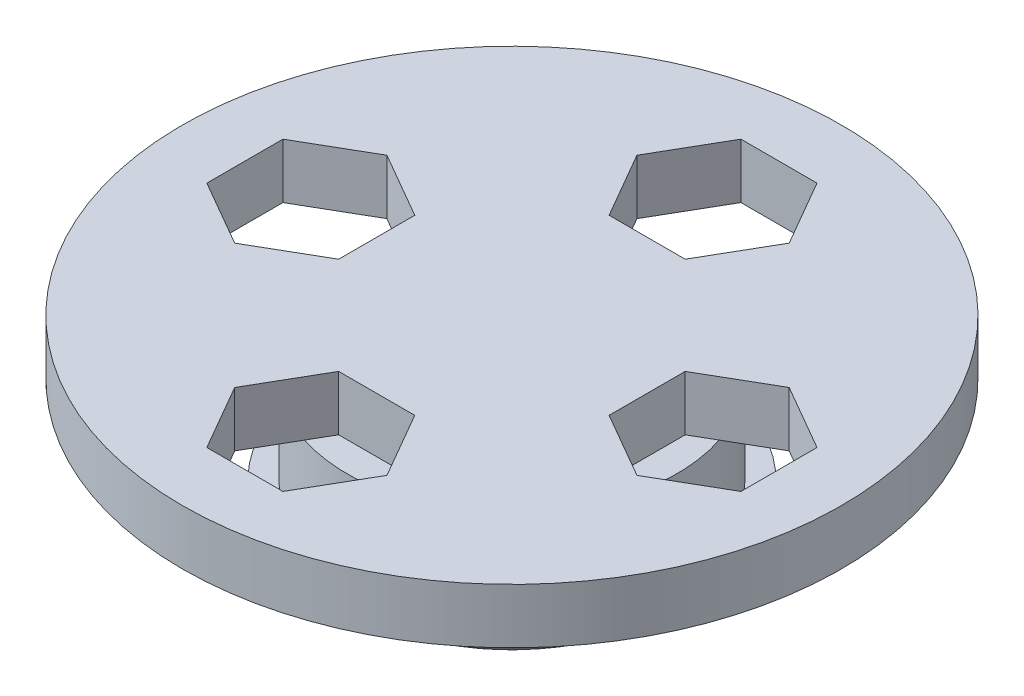
ISO-10303-21;
HEADER;
FILE_DESCRIPTION(('STEP AP214'),'2;1');
FILE_NAME('part.step','',(''),(''),'','','');
FILE_SCHEMA(('AUTOMOTIVE_DESIGN { 1 0 10303 214 1 1 1 1 }'));
ENDSEC;
DATA;
#1=APPLICATION_CONTEXT('core data for automotive mechanical design processes');
#2=APPLICATION_PROTOCOL_DEFINITION('international standard','automotive_design',2000,#1);
#3=PRODUCT_CONTEXT('',#1,'mechanical');
#4=PRODUCT('Part','Part','',(#3));
#5=PRODUCT_RELATED_PRODUCT_CATEGORY('part','',(#4));
#6=PRODUCT_DEFINITION_FORMATION('','',#4);
#7=PRODUCT_DEFINITION_CONTEXT('part definition',#1,'design');
#8=PRODUCT_DEFINITION('design','',#6,#7);
#9=PRODUCT_DEFINITION_SHAPE('','',#8);
#10=(LENGTH_UNIT() NAMED_UNIT(*) SI_UNIT(.MILLI.,.METRE.));
#11=(NAMED_UNIT(*) PLANE_ANGLE_UNIT() SI_UNIT($,.RADIAN.));
#12=(NAMED_UNIT(*) SI_UNIT($,.STERADIAN.) SOLID_ANGLE_UNIT());
#13=UNCERTAINTY_MEASURE_WITH_UNIT(LENGTH_MEASURE(1.E-05),#10,'distance_accuracy_value','');
#14=(GEOMETRIC_REPRESENTATION_CONTEXT(3) GLOBAL_UNCERTAINTY_ASSIGNED_CONTEXT((#13)) GLOBAL_UNIT_ASSIGNED_CONTEXT((#10,
#11,#12)) REPRESENTATION_CONTEXT('',''));
#15=CARTESIAN_POINT('',(0.,0.,0.));
#16=DIRECTION('',(0.,0.,1.));
#17=DIRECTION('',(1.,0.,0.));
#18=AXIS2_PLACEMENT_3D('',#15,#16,#17);
#19=CARTESIAN_POINT('',(0.,2.,0.));
#20=DIRECTION('',(0.,1.,0.));
#21=DIRECTION('',(0.,0.,1.));
#22=AXIS2_PLACEMENT_3D('',#19,#20,#21);
#23=PLANE('',#22);
#24=CARTESIAN_POINT('',(0.,2.,0.));
#25=DIRECTION('',(0.,1.,0.));
#26=DIRECTION('',(0.,0.,1.));
#27=AXIS2_PLACEMENT_3D('',#24,#25,#26);
#28=CIRCLE('',#27,7.5);
#29=CARTESIAN_POINT('',(0.,2.,7.5));
#30=VERTEX_POINT('',#29);
#31=EDGE_CURVE('E421',#30,#30,#28,.T.);
#32=ORIENTED_EDGE('',*,*,#31,.F.);
#33=EDGE_LOOP('',(#32));
#34=FACE_BOUND('',#33,.T.);
#35=CARTESIAN_POINT('',(0.,2.,0.));
#36=DIRECTION('',(0.,1.,0.));
#37=DIRECTION('',(0.,0.,1.));
#38=AXIS2_PLACEMENT_3D('',#35,#36,#37);
#39=CIRCLE('',#38,8.5);
#40=CARTESIAN_POINT('',(0.,2.,8.5));
#41=VERTEX_POINT('',#40);
#42=EDGE_CURVE('E426',#41,#41,#39,.T.);
#43=ORIENTED_EDGE('',*,*,#42,.T.);
#44=EDGE_LOOP('',(#43));
#45=FACE_BOUND('',#44,.T.);
#46=ADVANCED_FACE('F32',(#34,#45),#23,.T.);
#47=CARTESIAN_POINT('',(0.,0.,0.));
#48=DIRECTION('',(0.,1.,0.));
#49=DIRECTION('',(0.,0.,1.));
#50=AXIS2_PLACEMENT_3D('',#47,#48,#49);
#51=PLANE('',#50);
#52=CARTESIAN_POINT('',(0.,0.,0.));
#53=DIRECTION('',(0.,1.,0.));
#54=DIRECTION('',(0.,0.,1.));
#55=AXIS2_PLACEMENT_3D('',#52,#53,#54);
#56=CIRCLE('',#55,5.67157287525381);
#57=CARTESIAN_POINT('',(0.,0.,5.67157287525381));
#58=VERTEX_POINT('',#57);
#59=EDGE_CURVE('E434',#58,#58,#56,.F.);
#60=ORIENTED_EDGE('',*,*,#59,.T.);
#61=EDGE_LOOP('',(#60));
#62=FACE_BOUND('',#61,.T.);
#63=ADVANCED_FACE('F500',(#62),#51,.F.);
#64=CARTESIAN_POINT('',(0.,6.,0.));
#65=DIRECTION('',(0.,-1.,0.));
#66=DIRECTION('',(0.,0.,-1.));
#67=AXIS2_PLACEMENT_3D('',#64,#65,#66);
#68=CYLINDRICAL_SURFACE('',#67,7.5);
#69=CARTESIAN_POINT('',(0.,6.,0.));
#70=DIRECTION('',(0.,1.,0.));
#71=DIRECTION('',(0.,0.,1.));
#72=AXIS2_PLACEMENT_3D('',#69,#70,#71);
#73=CIRCLE('',#72,7.5);
#74=CARTESIAN_POINT('',(2.30044249277816,6.,-7.13848473679258));
#75=VERTEX_POINT('',#74);
#76=CARTESIAN_POINT('',(-2.30044249277816,6.,-7.13848473679258));
#77=VERTEX_POINT('',#76);
#78=EDGE_CURVE('E424',#75,#77,#73,.T.);
#79=ORIENTED_EDGE('',*,*,#78,.F.);
#80=CARTESIAN_POINT('',(7.13848473679258,6.,-2.30044249277814));
#81=VERTEX_POINT('',#80);
#82=EDGE_CURVE('E431',#81,#75,#73,.T.);
#83=ORIENTED_EDGE('',*,*,#82,.F.);
#84=CARTESIAN_POINT('',(7.13848473679257,6.,2.30044249277819));
#85=VERTEX_POINT('',#84);
#86=EDGE_CURVE('E464',#85,#81,#73,.T.);
#87=ORIENTED_EDGE('',*,*,#86,.F.);
#88=CARTESIAN_POINT('',(2.30044249277812,6.,7.13848473679259));
#89=VERTEX_POINT('',#88);
#90=EDGE_CURVE('E462',#89,#85,#73,.T.);
#91=ORIENTED_EDGE('',*,*,#90,.F.);
#92=CARTESIAN_POINT('',(-2.30044249277821,6.,7.13848473679256));
#93=VERTEX_POINT('',#92);
#94=EDGE_CURVE('E452',#93,#89,#73,.T.);
#95=ORIENTED_EDGE('',*,*,#94,.F.);
#96=CARTESIAN_POINT('',(-7.1384847367926,6.,2.30044249277809));
#97=VERTEX_POINT('',#96);
#98=EDGE_CURVE('E428',#97,#93,#73,.T.);
#99=ORIENTED_EDGE('',*,*,#98,.F.);
#100=CARTESIAN_POINT('',(-7.13848473679255,6.,-2.30044249277824));
#101=VERTEX_POINT('',#100);
#102=EDGE_CURVE('E463',#101,#97,#73,.T.);
#103=ORIENTED_EDGE('',*,*,#102,.F.);
#104=EDGE_CURVE('E427',#77,#101,#73,.T.);
#105=ORIENTED_EDGE('',*,*,#104,.F.);
#106=EDGE_LOOP('',(#79,#83,#87,#91,#95,#99,#103,#105));
#107=FACE_BOUND('',#106,.T.);
#108=ORIENTED_EDGE('',*,*,#31,.T.);
#109=EDGE_LOOP('',(#108));
#110=FACE_BOUND('',#109,.T.);
#111=ADVANCED_FACE('F458',(#107,#110),#68,.T.);
#112=CARTESIAN_POINT('',(0.,8.5,0.));
#113=DIRECTION('',(0.,-1.,0.));
#114=DIRECTION('',(0.,0.,-1.));
#115=AXIS2_PLACEMENT_3D('',#112,#113,#114);
#116=CYLINDRICAL_SURFACE('',#115,15.);
#117=CARTESIAN_POINT('',(0.,8.5,0.));
#118=DIRECTION('',(0.,1.,0.));
#119=DIRECTION('',(0.,0.,1.));
#120=AXIS2_PLACEMENT_3D('',#117,#118,#119);
#121=CIRCLE('',#120,15.);
#122=CARTESIAN_POINT('',(0.,8.5,15.));
#123=VERTEX_POINT('',#122);
#124=EDGE_CURVE('E418',#123,#123,#121,.T.);
#125=ORIENTED_EDGE('',*,*,#124,.F.);
#126=EDGE_LOOP('',(#125));
#127=FACE_BOUND('',#126,.T.);
#128=CARTESIAN_POINT('',(0.,6.,0.));
#129=DIRECTION('',(0.,1.,0.));
#130=DIRECTION('',(0.,0.,1.));
#131=AXIS2_PLACEMENT_3D('',#128,#129,#130);
#132=CIRCLE('',#131,15.);
#133=CARTESIAN_POINT('',(0.,6.,15.));
#134=VERTEX_POINT('',#133);
#135=EDGE_CURVE('E407',#134,#134,#132,.T.);
#136=ORIENTED_EDGE('',*,*,#135,.T.);
#137=EDGE_LOOP('',(#136));
#138=FACE_BOUND('',#137,.T.);
#139=ADVANCED_FACE('F512',(#127,#138),#116,.T.);
#140=CARTESIAN_POINT('',(0.,8.5,0.));
#141=DIRECTION('',(0.,1.,0.));
#142=DIRECTION('',(0.,0.,1.));
#143=AXIS2_PLACEMENT_3D('',#140,#141,#142);
#144=PLANE('',#143);
#145=DIRECTION('',(-0.866025403784444,0.,0.499999999999991));
#146=VECTOR('',#145,1.);
#147=CARTESIAN_POINT('',(-9.15400145941037,8.5,-3.46410161513785));
#148=LINE('',#147,#146);
#149=CARTESIAN_POINT('',(-9.15400145941037,8.5,-3.46410161513785));
#150=VERTEX_POINT('',#149);
#151=CARTESIAN_POINT('',(-12.1540014594104,8.5,-1.732050807569));
#152=VERTEX_POINT('',#151);
#153=EDGE_CURVE('E47',#150,#152,#148,.T.);
#154=ORIENTED_EDGE('',*,*,#153,.F.);
#155=DIRECTION('',(-0.866025403784433,0.,-0.500000000000009));
#156=VECTOR('',#155,1.);
#157=CARTESIAN_POINT('',(-6.15400145941038,8.5,-1.73205080756894));
#158=LINE('',#157,#156);
#159=CARTESIAN_POINT('',(-6.15400145941038,8.5,-1.73205080756894));
#160=VERTEX_POINT('',#159);
#161=EDGE_CURVE('E234',#160,#150,#158,.T.);
#162=ORIENTED_EDGE('',*,*,#161,.F.);
#163=DIRECTION('',(0.,0.,-1.));
#164=VECTOR('',#163,1.);
#165=CARTESIAN_POINT('',(-6.15400145941042,8.5,1.73205080756882));
#166=LINE('',#165,#164);
#167=CARTESIAN_POINT('',(-6.15400145941042,8.5,1.73205080756882));
#168=VERTEX_POINT('',#167);
#169=EDGE_CURVE('E237',#168,#160,#166,.T.);
#170=ORIENTED_EDGE('',*,*,#169,.F.);
#171=DIRECTION('',(0.866025403784444,0.,-0.499999999999991));
#172=VECTOR('',#171,1.);
#173=CARTESIAN_POINT('',(-9.15400145941044,8.5,3.46410161513766));
#174=LINE('',#173,#172);
#175=CARTESIAN_POINT('',(-9.15400145941044,8.5,3.46410161513766));
#176=VERTEX_POINT('',#175);
#177=EDGE_CURVE('E256',#176,#168,#174,.T.);
#178=ORIENTED_EDGE('',*,*,#177,.F.);
#179=DIRECTION('',(0.866025403784433,0.,0.500000000000009));
#180=VECTOR('',#179,1.);
#181=CARTESIAN_POINT('',(-12.1540014594104,8.5,1.73205080756875));
#182=LINE('',#181,#180);
#183=CARTESIAN_POINT('',(-12.1540014594104,8.5,1.73205080756875));
#184=VERTEX_POINT('',#183);
#185=EDGE_CURVE('E253',#184,#176,#182,.T.);
#186=ORIENTED_EDGE('',*,*,#185,.F.);
#187=DIRECTION('',(0.,0.,1.));
#188=VECTOR('',#187,1.);
#189=CARTESIAN_POINT('',(-12.1540014594104,8.5,-1.732050807569));
#190=LINE('',#189,#188);
#191=EDGE_CURVE('E251',#152,#184,#190,.T.);
#192=ORIENTED_EDGE('',*,*,#191,.F.);
#193=EDGE_LOOP('',(#154,#162,#170,#178,#186,#192));
#194=FACE_BOUND('',#193,.T.);
#195=DIRECTION('',(0.499999999999994,0.,0.866025403784442));
#196=VECTOR('',#195,1.);
#197=CARTESIAN_POINT('',(-3.46410161513782,8.5,9.15400145941038));
#198=LINE('',#197,#196);
#199=CARTESIAN_POINT('',(-3.46410161513782,8.5,9.15400145941038));
#200=VERTEX_POINT('',#199);
#201=CARTESIAN_POINT('',(-1.73205080756896,8.5,12.1540014594104));
#202=VERTEX_POINT('',#201);
#203=EDGE_CURVE('E263',#200,#202,#198,.T.);
#204=ORIENTED_EDGE('',*,*,#203,.F.);
#205=DIRECTION('',(-0.500000000000006,0.,0.866025403784435));
#206=VECTOR('',#205,1.);
#207=CARTESIAN_POINT('',(-1.73205080756892,8.5,6.15400145941039));
#208=LINE('',#207,#206);
#209=CARTESIAN_POINT('',(-1.73205080756892,8.5,6.15400145941039));
#210=VERTEX_POINT('',#209);
#211=EDGE_CURVE('E275',#210,#200,#208,.T.);
#212=ORIENTED_EDGE('',*,*,#211,.F.);
#213=DIRECTION('',(-1.,0.,0.));
#214=VECTOR('',#213,1.);
#215=CARTESIAN_POINT('',(1.73205080756884,8.5,6.15400145941042));
#216=LINE('',#215,#214);
#217=CARTESIAN_POINT('',(1.73205080756884,8.5,6.15400145941042));
#218=VERTEX_POINT('',#217);
#219=EDGE_CURVE('E302',#218,#210,#216,.T.);
#220=ORIENTED_EDGE('',*,*,#219,.F.);
#221=DIRECTION('',(-0.499999999999994,0.,-0.866025403784442));
#222=VECTOR('',#221,1.);
#223=CARTESIAN_POINT('',(3.46410161513769,8.5,9.15400145941043));
#224=LINE('',#223,#222);
#225=CARTESIAN_POINT('',(3.46410161513769,8.5,9.15400145941043));
#226=VERTEX_POINT('',#225);
#227=EDGE_CURVE('E299',#226,#218,#224,.T.);
#228=ORIENTED_EDGE('',*,*,#227,.F.);
#229=DIRECTION('',(0.500000000000006,0.,-0.866025403784435));
#230=VECTOR('',#229,1.);
#231=CARTESIAN_POINT('',(1.73205080756879,8.5,12.1540014594104));
#232=LINE('',#231,#230);
#233=CARTESIAN_POINT('',(1.73205080756879,8.5,12.1540014594104));
#234=VERTEX_POINT('',#233);
#235=EDGE_CURVE('E296',#234,#226,#232,.T.);
#236=ORIENTED_EDGE('',*,*,#235,.F.);
#237=DIRECTION('',(1.,0.,0.));
#238=VECTOR('',#237,1.);
#239=CARTESIAN_POINT('',(-1.73205080756896,8.5,12.1540014594104));
#240=LINE('',#239,#238);
#241=EDGE_CURVE('E293',#202,#234,#240,.T.);
#242=ORIENTED_EDGE('',*,*,#241,.F.);
#243=EDGE_LOOP('',(#204,#212,#220,#228,#236,#242));
#244=FACE_BOUND('',#243,.T.);
#245=DIRECTION('',(0.86602540378444,0.,-0.499999999999997));
#246=VECTOR('',#245,1.);
#247=CARTESIAN_POINT('',(9.15400145941039,8.5,3.46410161513778));
#248=LINE('',#247,#246);
#249=CARTESIAN_POINT('',(9.15400145941039,8.5,3.46410161513778));
#250=VERTEX_POINT('',#249);
#251=CARTESIAN_POINT('',(12.1540014594104,8.5,1.73205080756892));
#252=VERTEX_POINT('',#251);
#253=EDGE_CURVE('E309',#250,#252,#248,.T.);
#254=ORIENTED_EDGE('',*,*,#253,.F.);
#255=DIRECTION('',(0.866025403784437,0.,0.500000000000003));
#256=VECTOR('',#255,1.);
#257=CARTESIAN_POINT('',(6.1540014594104,8.5,1.7320508075689));
#258=LINE('',#257,#256);
#259=CARTESIAN_POINT('',(6.1540014594104,8.5,1.7320508075689));
#260=VERTEX_POINT('',#259);
#261=EDGE_CURVE('E324',#260,#250,#258,.T.);
#262=ORIENTED_EDGE('',*,*,#261,.F.);
#263=DIRECTION('',(0.,0.,1.));
#264=VECTOR('',#263,1.);
#265=CARTESIAN_POINT('',(6.15400145941041,8.5,-1.73205080756886));
#266=LINE('',#265,#264);
#267=CARTESIAN_POINT('',(6.15400145941041,8.5,-1.73205080756886));
#268=VERTEX_POINT('',#267);
#269=EDGE_CURVE('E351',#268,#260,#266,.T.);
#270=ORIENTED_EDGE('',*,*,#269,.F.);
#271=DIRECTION('',(-0.86602540378444,0.,0.499999999999997));
#272=VECTOR('',#271,1.);
#273=CARTESIAN_POINT('',(9.15400145941041,8.5,-3.46410161513773));
#274=LINE('',#273,#272);
#275=CARTESIAN_POINT('',(9.15400145941041,8.5,-3.46410161513773));
#276=VERTEX_POINT('',#275);
#277=EDGE_CURVE('E348',#276,#268,#274,.T.);
#278=ORIENTED_EDGE('',*,*,#277,.F.);
#279=DIRECTION('',(-0.866025403784437,0.,-0.500000000000003));
#280=VECTOR('',#279,1.);
#281=CARTESIAN_POINT('',(12.1540014594104,8.5,-1.73205080756884));
#282=LINE('',#281,#280);
#283=CARTESIAN_POINT('',(12.1540014594104,8.5,-1.73205080756884));
#284=VERTEX_POINT('',#283);
#285=EDGE_CURVE('E345',#284,#276,#282,.T.);
#286=ORIENTED_EDGE('',*,*,#285,.F.);
#287=DIRECTION('',(0.,0.,-1.));
#288=VECTOR('',#287,1.);
#289=CARTESIAN_POINT('',(12.1540014594104,8.5,1.73205080756892));
#290=LINE('',#289,#288);
#291=EDGE_CURVE('E342',#252,#284,#290,.T.);
#292=ORIENTED_EDGE('',*,*,#291,.F.);
#293=EDGE_LOOP('',(#254,#262,#270,#278,#286,#292));
#294=FACE_BOUND('',#293,.T.);
#295=DIRECTION('',(0.5,0.,-0.866025403784438));
#296=VECTOR('',#295,1.);
#297=CARTESIAN_POINT('',(1.73205080756888,8.5,-6.1540014594104));
#298=LINE('',#297,#296);
#299=CARTESIAN_POINT('',(1.73205080756888,8.5,-6.1540014594104));
#300=VERTEX_POINT('',#299);
#301=CARTESIAN_POINT('',(3.46410161513775,8.5,-9.1540014594104));
#302=VERTEX_POINT('',#301);
#303=EDGE_CURVE('E358',#300,#302,#298,.T.);
#304=ORIENTED_EDGE('',*,*,#303,.F.);
#305=DIRECTION('',(1.,0.,0.));
#306=VECTOR('',#305,1.);
#307=CARTESIAN_POINT('',(-1.73205080756888,8.5,-6.1540014594104));
#308=LINE('',#307,#306);
#309=CARTESIAN_POINT('',(-1.73205080756888,8.5,-6.1540014594104));
#310=VERTEX_POINT('',#309);
#311=EDGE_CURVE('E373',#310,#300,#308,.T.);
#312=ORIENTED_EDGE('',*,*,#311,.F.);
#313=DIRECTION('',(0.5,0.,0.866025403784439));
#314=VECTOR('',#313,1.);
#315=CARTESIAN_POINT('',(-3.46410161513776,8.5,-9.1540014594104));
#316=LINE('',#315,#314);
#317=CARTESIAN_POINT('',(-3.46410161513776,8.5,-9.1540014594104));
#318=VERTEX_POINT('',#317);
#319=EDGE_CURVE('E400',#318,#310,#316,.T.);
#320=ORIENTED_EDGE('',*,*,#319,.F.);
#321=DIRECTION('',(-0.5,0.,0.866025403784439));
#322=VECTOR('',#321,1.);
#323=CARTESIAN_POINT('',(-1.73205080756888,8.5,-12.1540014594104));
#324=LINE('',#323,#322);
#325=CARTESIAN_POINT('',(-1.73205080756888,8.5,-12.1540014594104));
#326=VERTEX_POINT('',#325);
#327=EDGE_CURVE('E397',#326,#318,#324,.T.);
#328=ORIENTED_EDGE('',*,*,#327,.F.);
#329=DIRECTION('',(-1.,0.,0.));
#330=VECTOR('',#329,1.);
#331=CARTESIAN_POINT('',(1.73205080756888,8.5,-12.1540014594104));
#332=LINE('',#331,#330);
#333=CARTESIAN_POINT('',(1.73205080756888,8.5,-12.1540014594104));
#334=VERTEX_POINT('',#333);
#335=EDGE_CURVE('E394',#334,#326,#332,.T.);
#336=ORIENTED_EDGE('',*,*,#335,.F.);
#337=DIRECTION('',(-0.5,0.,-0.866025403784439));
#338=VECTOR('',#337,1.);
#339=CARTESIAN_POINT('',(3.46410161513775,8.5,-9.1540014594104));
#340=LINE('',#339,#338);
#341=EDGE_CURVE('E391',#302,#334,#340,.T.);
#342=ORIENTED_EDGE('',*,*,#341,.F.);
#343=EDGE_LOOP('',(#304,#312,#320,#328,#336,#342));
#344=FACE_BOUND('',#343,.T.);
#345=ORIENTED_EDGE('',*,*,#124,.T.);
#346=EDGE_LOOP('',(#345));
#347=FACE_BOUND('',#346,.T.);
#348=ADVANCED_FACE('F487',(#194,#244,#294,#344,#347),#144,.T.);
#349=CARTESIAN_POINT('',(0.,6.,0.));
#350=DIRECTION('',(0.,1.,0.));
#351=DIRECTION('',(0.,0.,1.));
#352=AXIS2_PLACEMENT_3D('',#349,#350,#351);
#353=PLANE('',#352);
#354=ORIENTED_EDGE('',*,*,#104,.T.);
#355=DIRECTION('',(-0.866025403784433,0.,-0.500000000000009));
#356=VECTOR('',#355,1.);
#357=CARTESIAN_POINT('',(-0.788500364852616,6.,1.36572269371129));
#358=LINE('',#357,#356);
#359=CARTESIAN_POINT('',(-9.15400145941037,6.,-3.46410161513785));
#360=VERTEX_POINT('',#359);
#361=EDGE_CURVE('E11',#101,#360,#358,.T.);
#362=ORIENTED_EDGE('',*,*,#361,.T.);
#363=DIRECTION('',(-0.866025403784444,0.,0.499999999999991));
#364=VECTOR('',#363,1.);
#365=CARTESIAN_POINT('',(-9.15400145941037,6.,-3.46410161513785));
#366=LINE('',#365,#364);
#367=CARTESIAN_POINT('',(-12.1540014594104,6.,-1.732050807569));
#368=VERTEX_POINT('',#367);
#369=EDGE_CURVE('E219',#360,#368,#366,.T.);
#370=ORIENTED_EDGE('',*,*,#369,.T.);
#371=DIRECTION('',(0.,0.,1.));
#372=VECTOR('',#371,1.);
#373=CARTESIAN_POINT('',(-12.1540014594104,6.,-1.732050807569));
#374=LINE('',#373,#372);
#375=CARTESIAN_POINT('',(-12.1540014594104,6.,1.73205080756875));
#376=VERTEX_POINT('',#375);
#377=EDGE_CURVE('E227',#368,#376,#374,.T.);
#378=ORIENTED_EDGE('',*,*,#377,.T.);
#379=DIRECTION('',(0.866025403784433,0.,0.500000000000009));
#380=VECTOR('',#379,1.);
#381=CARTESIAN_POINT('',(-12.1540014594104,6.,1.73205080756875));
#382=LINE('',#381,#380);
#383=CARTESIAN_POINT('',(-9.15400145941044,6.,3.46410161513766));
#384=VERTEX_POINT('',#383);
#385=EDGE_CURVE('E55',#376,#384,#382,.T.);
#386=ORIENTED_EDGE('',*,*,#385,.T.);
#387=DIRECTION('',(0.866025403784444,0.,-0.499999999999991));
#388=VECTOR('',#387,1.);
#389=CARTESIAN_POINT('',(-9.15400145941044,6.,3.46410161513766));
#390=LINE('',#389,#388);
#391=EDGE_CURVE('E242',#384,#97,#390,.T.);
#392=ORIENTED_EDGE('',*,*,#391,.T.);
#393=ORIENTED_EDGE('',*,*,#98,.T.);
#394=DIRECTION('',(-0.500000000000006,0.,0.866025403784435));
#395=VECTOR('',#394,1.);
#396=CARTESIAN_POINT('',(1.3657226937113,6.,0.788500364852611));
#397=LINE('',#396,#395);
#398=CARTESIAN_POINT('',(-3.46410161513782,6.,9.15400145941038));
#399=VERTEX_POINT('',#398);
#400=EDGE_CURVE('E40',#93,#399,#397,.T.);
#401=ORIENTED_EDGE('',*,*,#400,.T.);
#402=DIRECTION('',(0.499999999999994,0.,0.866025403784442));
#403=VECTOR('',#402,1.);
#404=CARTESIAN_POINT('',(-3.46410161513782,6.,9.15400145941038));
#405=LINE('',#404,#403);
#406=CARTESIAN_POINT('',(-1.73205080756896,6.,12.1540014594104));
#407=VERTEX_POINT('',#406);
#408=EDGE_CURVE('E271',#399,#407,#405,.T.);
#409=ORIENTED_EDGE('',*,*,#408,.T.);
#410=DIRECTION('',(1.,0.,0.));
#411=VECTOR('',#410,1.);
#412=CARTESIAN_POINT('',(-1.73205080756896,6.,12.1540014594104));
#413=LINE('',#412,#411);
#414=CARTESIAN_POINT('',(1.73205080756879,6.,12.1540014594104));
#415=VERTEX_POINT('',#414);
#416=EDGE_CURVE('E274',#407,#415,#413,.T.);
#417=ORIENTED_EDGE('',*,*,#416,.T.);
#418=DIRECTION('',(0.500000000000006,0.,-0.866025403784435));
#419=VECTOR('',#418,1.);
#420=CARTESIAN_POINT('',(1.73205080756879,6.,12.1540014594104));
#421=LINE('',#420,#419);
#422=CARTESIAN_POINT('',(3.46410161513769,6.,9.15400145941043));
#423=VERTEX_POINT('',#422);
#424=EDGE_CURVE('E278',#415,#423,#421,.T.);
#425=ORIENTED_EDGE('',*,*,#424,.T.);
#426=DIRECTION('',(-0.499999999999994,0.,-0.866025403784442));
#427=VECTOR('',#426,1.);
#428=CARTESIAN_POINT('',(3.46410161513769,6.,9.15400145941043));
#429=LINE('',#428,#427);
#430=EDGE_CURVE('E282',#423,#89,#429,.T.);
#431=ORIENTED_EDGE('',*,*,#430,.T.);
#432=ORIENTED_EDGE('',*,*,#90,.T.);
#433=DIRECTION('',(0.866025403784437,0.,0.500000000000003));
#434=VECTOR('',#433,1.);
#435=CARTESIAN_POINT('',(0.788500364852608,6.,-1.3657226937113));
#436=LINE('',#435,#434);
#437=CARTESIAN_POINT('',(9.15400145941039,6.,3.46410161513778));
#438=VERTEX_POINT('',#437);
#439=EDGE_CURVE('E440',#85,#438,#436,.T.);
#440=ORIENTED_EDGE('',*,*,#439,.T.);
#441=DIRECTION('',(0.86602540378444,0.,-0.499999999999997));
#442=VECTOR('',#441,1.);
#443=CARTESIAN_POINT('',(9.15400145941039,6.,3.46410161513778));
#444=LINE('',#443,#442);
#445=CARTESIAN_POINT('',(12.1540014594104,6.,1.73205080756892));
#446=VERTEX_POINT('',#445);
#447=EDGE_CURVE('E320',#438,#446,#444,.T.);
#448=ORIENTED_EDGE('',*,*,#447,.T.);
#449=DIRECTION('',(0.,0.,-1.));
#450=VECTOR('',#449,1.);
#451=CARTESIAN_POINT('',(12.1540014594104,6.,1.73205080756892));
#452=LINE('',#451,#450);
#453=CARTESIAN_POINT('',(12.1540014594104,6.,-1.73205080756884));
#454=VERTEX_POINT('',#453);
#455=EDGE_CURVE('E323',#446,#454,#452,.T.);
#456=ORIENTED_EDGE('',*,*,#455,.T.);
#457=DIRECTION('',(-0.866025403784437,0.,-0.500000000000003));
#458=VECTOR('',#457,1.);
#459=CARTESIAN_POINT('',(12.1540014594104,6.,-1.73205080756884));
#460=LINE('',#459,#458);
#461=CARTESIAN_POINT('',(9.15400145941041,6.,-3.46410161513773));
#462=VERTEX_POINT('',#461);
#463=EDGE_CURVE('E327',#454,#462,#460,.T.);
#464=ORIENTED_EDGE('',*,*,#463,.T.);
#465=DIRECTION('',(-0.86602540378444,0.,0.499999999999997));
#466=VECTOR('',#465,1.);
#467=CARTESIAN_POINT('',(9.15400145941041,6.,-3.46410161513773));
#468=LINE('',#467,#466);
#469=EDGE_CURVE('E331',#462,#81,#468,.T.);
#470=ORIENTED_EDGE('',*,*,#469,.T.);
#471=ORIENTED_EDGE('',*,*,#82,.T.);
#472=DIRECTION('',(0.5,0.,-0.866025403784439));
#473=VECTOR('',#472,1.);
#474=CARTESIAN_POINT('',(-1.3657226937113,6.,-0.788500364852602));
#475=LINE('',#474,#473);
#476=CARTESIAN_POINT('',(3.46410161513775,6.,-9.1540014594104));
#477=VERTEX_POINT('',#476);
#478=EDGE_CURVE('E437',#75,#477,#475,.T.);
#479=ORIENTED_EDGE('',*,*,#478,.T.);
#480=DIRECTION('',(-0.5,0.,-0.866025403784439));
#481=VECTOR('',#480,1.);
#482=CARTESIAN_POINT('',(3.46410161513775,6.,-9.1540014594104));
#483=LINE('',#482,#481);
#484=CARTESIAN_POINT('',(1.73205080756888,6.,-12.1540014594104));
#485=VERTEX_POINT('',#484);
#486=EDGE_CURVE('E372',#477,#485,#483,.T.);
#487=ORIENTED_EDGE('',*,*,#486,.T.);
#488=DIRECTION('',(-1.,0.,0.));
#489=VECTOR('',#488,1.);
#490=CARTESIAN_POINT('',(1.73205080756888,6.,-12.1540014594104));
#491=LINE('',#490,#489);
#492=CARTESIAN_POINT('',(-1.73205080756888,6.,-12.1540014594104));
#493=VERTEX_POINT('',#492);
#494=EDGE_CURVE('E376',#485,#493,#491,.T.);
#495=ORIENTED_EDGE('',*,*,#494,.T.);
#496=DIRECTION('',(-0.5,0.,0.866025403784439));
#497=VECTOR('',#496,1.);
#498=CARTESIAN_POINT('',(-1.73205080756888,6.,-12.1540014594104));
#499=LINE('',#498,#497);
#500=CARTESIAN_POINT('',(-3.46410161513776,6.,-9.1540014594104));
#501=VERTEX_POINT('',#500);
#502=EDGE_CURVE('E379',#493,#501,#499,.T.);
#503=ORIENTED_EDGE('',*,*,#502,.T.);
#504=DIRECTION('',(0.5,0.,0.866025403784439));
#505=VECTOR('',#504,1.);
#506=CARTESIAN_POINT('',(-3.46410161513776,6.,-9.1540014594104));
#507=LINE('',#506,#505);
#508=EDGE_CURVE('E383',#501,#77,#507,.T.);
#509=ORIENTED_EDGE('',*,*,#508,.T.);
#510=EDGE_LOOP('',(#354,#362,#370,#378,#386,#392,#393,#401,#409,#417,#425,#431,#432,#440,#448,
#456,#464,#470,#471,#479,#487,#495,#503,#509));
#511=FACE_BOUND('',#510,.T.);
#512=ORIENTED_EDGE('',*,*,#135,.F.);
#513=EDGE_LOOP('',(#512));
#514=FACE_BOUND('',#513,.T.);
#515=ADVANCED_FACE('F232',(#511,#514),#353,.F.);
#516=CARTESIAN_POINT('',(0.,3.,0.));
#517=DIRECTION('',(0.,-1.,0.));
#518=DIRECTION('',(0.,0.,-1.));
#519=AXIS2_PLACEMENT_3D('',#516,#517,#518);
#520=TOROIDAL_SURFACE('',#519,5.67157287525381,3.);
#521=ORIENTED_EDGE('',*,*,#59,.F.);
#522=EDGE_LOOP('',(#521));
#523=FACE_BOUND('',#522,.T.);
#524=ORIENTED_EDGE('',*,*,#42,.F.);
#525=EDGE_LOOP('',(#524));
#526=FACE_BOUND('',#525,.T.);
#527=ADVANCED_FACE('F34',(#523,#526),#520,.T.);
#528=CARTESIAN_POINT('',(0.,6.,0.));
#529=DIRECTION('',(0.,1.,0.));
#530=DIRECTION('',(0.,0.,1.));
#531=AXIS2_PLACEMENT_3D('',#528,#529,#530);
#532=PLANE('',#531);
#533=ORIENTED_EDGE('',*,*,#78,.T.);
#534=CARTESIAN_POINT('',(-1.73205080756888,6.,-6.1540014594104));
#535=VERTEX_POINT('',#534);
#536=EDGE_CURVE('E382',#77,#535,#507,.T.);
#537=ORIENTED_EDGE('',*,*,#536,.T.);
#538=DIRECTION('',(1.,0.,0.));
#539=VECTOR('',#538,1.);
#540=CARTESIAN_POINT('',(-1.73205080756888,6.,-6.1540014594104));
#541=LINE('',#540,#539);
#542=CARTESIAN_POINT('',(1.73205080756888,6.,-6.1540014594104));
#543=VERTEX_POINT('',#542);
#544=EDGE_CURVE('E386',#535,#543,#541,.T.);
#545=ORIENTED_EDGE('',*,*,#544,.T.);
#546=DIRECTION('',(0.5,0.,-0.866025403784438));
#547=VECTOR('',#546,1.);
#548=CARTESIAN_POINT('',(1.73205080756888,6.,-6.1540014594104));
#549=LINE('',#548,#547);
#550=EDGE_CURVE('E369',#543,#75,#549,.T.);
#551=ORIENTED_EDGE('',*,*,#550,.T.);
#552=EDGE_LOOP('',(#533,#537,#545,#551));
#553=FACE_BOUND('',#552,.T.);
#554=ADVANCED_FACE('F524',(#553),#532,.T.);
#555=CARTESIAN_POINT('',(1.73205080756888,6.,-6.1540014594104));
#556=DIRECTION('',(0.866025403784439,0.,0.5));
#557=DIRECTION('',(0.5,0.,-0.866025403784439));
#558=AXIS2_PLACEMENT_3D('',#555,#556,#557);
#559=PLANE('',#558);
#560=ORIENTED_EDGE('',*,*,#303,.T.);
#561=DIRECTION('',(0.,1.,0.));
#562=VECTOR('',#561,1.);
#563=CARTESIAN_POINT('',(3.46410161513775,6.,-9.1540014594104));
#564=LINE('',#563,#562);
#565=EDGE_CURVE('E389',#477,#302,#564,.T.);
#566=ORIENTED_EDGE('',*,*,#565,.F.);
#567=ORIENTED_EDGE('',*,*,#478,.F.);
#568=ORIENTED_EDGE('',*,*,#550,.F.);
#569=DIRECTION('',(0.,1.,0.));
#570=VECTOR('',#569,1.);
#571=CARTESIAN_POINT('',(1.73205080756888,6.,-6.1540014594104));
#572=LINE('',#571,#570);
#573=EDGE_CURVE('E405',#543,#300,#572,.T.);
#574=ORIENTED_EDGE('',*,*,#573,.T.);
#575=EDGE_LOOP('',(#560,#566,#567,#568,#574));
#576=FACE_BOUND('',#575,.T.);
#577=ADVANCED_FACE('F520',(#576),#559,.F.);
#578=CARTESIAN_POINT('',(-1.73205080756888,6.,-6.1540014594104));
#579=DIRECTION('',(0.,0.,1.));
#580=DIRECTION('',(1.,0.,0.));
#581=AXIS2_PLACEMENT_3D('',#578,#579,#580);
#582=PLANE('',#581);
#583=ORIENTED_EDGE('',*,*,#311,.T.);
#584=ORIENTED_EDGE('',*,*,#573,.F.);
#585=ORIENTED_EDGE('',*,*,#544,.F.);
#586=DIRECTION('',(0.,1.,0.));
#587=VECTOR('',#586,1.);
#588=CARTESIAN_POINT('',(-1.73205080756888,6.,-6.1540014594104));
#589=LINE('',#588,#587);
#590=EDGE_CURVE('E408',#535,#310,#589,.T.);
#591=ORIENTED_EDGE('',*,*,#590,.T.);
#592=EDGE_LOOP('',(#583,#584,#585,#591));
#593=FACE_BOUND('',#592,.T.);
#594=ADVANCED_FACE('F523',(#593),#582,.F.);
#595=CARTESIAN_POINT('',(-3.46410161513776,6.,-9.1540014594104));
#596=DIRECTION('',(-0.866025403784439,0.,0.5));
#597=DIRECTION('',(0.5,0.,0.866025403784439));
#598=AXIS2_PLACEMENT_3D('',#595,#596,#597);
#599=PLANE('',#598);
#600=ORIENTED_EDGE('',*,*,#319,.T.);
#601=ORIENTED_EDGE('',*,*,#590,.F.);
#602=ORIENTED_EDGE('',*,*,#536,.F.);
#603=ORIENTED_EDGE('',*,*,#508,.F.);
#604=DIRECTION('',(0.,1.,0.));
#605=VECTOR('',#604,1.);
#606=CARTESIAN_POINT('',(-3.46410161513776,6.,-9.1540014594104));
#607=LINE('',#606,#605);
#608=EDGE_CURVE('E410',#501,#318,#607,.T.);
#609=ORIENTED_EDGE('',*,*,#608,.T.);
#610=EDGE_LOOP('',(#600,#601,#602,#603,#609));
#611=FACE_BOUND('',#610,.T.);
#612=ADVANCED_FACE('F538',(#611),#599,.F.);
#613=CARTESIAN_POINT('',(-1.73205080756888,6.,-12.1540014594104));
#614=DIRECTION('',(-0.866025403784439,0.,-0.5));
#615=DIRECTION('',(-0.5,0.,0.866025403784439));
#616=AXIS2_PLACEMENT_3D('',#613,#614,#615);
#617=PLANE('',#616);
#618=ORIENTED_EDGE('',*,*,#327,.T.);
#619=ORIENTED_EDGE('',*,*,#608,.F.);
#620=ORIENTED_EDGE('',*,*,#502,.F.);
#621=DIRECTION('',(0.,1.,0.));
#622=VECTOR('',#621,1.);
#623=CARTESIAN_POINT('',(-1.73205080756888,6.,-12.1540014594104));
#624=LINE('',#623,#622);
#625=EDGE_CURVE('E412',#493,#326,#624,.T.);
#626=ORIENTED_EDGE('',*,*,#625,.T.);
#627=EDGE_LOOP('',(#618,#619,#620,#626));
#628=FACE_BOUND('',#627,.T.);
#629=ADVANCED_FACE('F534',(#628),#617,.F.);
#630=CARTESIAN_POINT('',(1.73205080756888,6.,-12.1540014594104));
#631=DIRECTION('',(0.,0.,-1.));
#632=DIRECTION('',(-1.,0.,0.));
#633=AXIS2_PLACEMENT_3D('',#630,#631,#632);
#634=PLANE('',#633);
#635=ORIENTED_EDGE('',*,*,#335,.T.);
#636=ORIENTED_EDGE('',*,*,#625,.F.);
#637=ORIENTED_EDGE('',*,*,#494,.F.);
#638=DIRECTION('',(0.,1.,0.));
#639=VECTOR('',#638,1.);
#640=CARTESIAN_POINT('',(1.73205080756888,6.,-12.1540014594104));
#641=LINE('',#640,#639);
#642=EDGE_CURVE('E414',#485,#334,#641,.T.);
#643=ORIENTED_EDGE('',*,*,#642,.T.);
#644=EDGE_LOOP('',(#635,#636,#637,#643));
#645=FACE_BOUND('',#644,.T.);
#646=ADVANCED_FACE('F530',(#645),#634,.F.);
#647=CARTESIAN_POINT('',(3.46410161513775,6.,-9.1540014594104));
#648=DIRECTION('',(0.866025403784439,0.,-0.5));
#649=DIRECTION('',(-0.5,0.,-0.866025403784439));
#650=AXIS2_PLACEMENT_3D('',#647,#648,#649);
#651=PLANE('',#650);
#652=ORIENTED_EDGE('',*,*,#341,.T.);
#653=ORIENTED_EDGE('',*,*,#642,.F.);
#654=ORIENTED_EDGE('',*,*,#486,.F.);
#655=ORIENTED_EDGE('',*,*,#565,.T.);
#656=EDGE_LOOP('',(#652,#653,#654,#655));
#657=FACE_BOUND('',#656,.T.);
#658=ADVANCED_FACE('F526',(#657),#651,.F.);
#659=CARTESIAN_POINT('',(0.,6.,0.));
#660=DIRECTION('',(0.,1.,0.));
#661=DIRECTION('',(0.,0.,1.));
#662=AXIS2_PLACEMENT_3D('',#659,#660,#661);
#663=PLANE('',#662);
#664=ORIENTED_EDGE('',*,*,#86,.T.);
#665=CARTESIAN_POINT('',(6.15400145941041,6.,-1.73205080756886));
#666=VERTEX_POINT('',#665);
#667=EDGE_CURVE('E330',#81,#666,#468,.T.);
#668=ORIENTED_EDGE('',*,*,#667,.T.);
#669=DIRECTION('',(0.,0.,1.));
#670=VECTOR('',#669,1.);
#671=CARTESIAN_POINT('',(6.15400145941041,6.,-1.73205080756886));
#672=LINE('',#671,#670);
#673=CARTESIAN_POINT('',(6.1540014594104,6.,1.7320508075689));
#674=VERTEX_POINT('',#673);
#675=EDGE_CURVE('E334',#666,#674,#672,.T.);
#676=ORIENTED_EDGE('',*,*,#675,.T.);
#677=DIRECTION('',(0.866025403784437,0.,0.500000000000003));
#678=VECTOR('',#677,1.);
#679=CARTESIAN_POINT('',(6.1540014594104,6.,1.7320508075689));
#680=LINE('',#679,#678);
#681=EDGE_CURVE('E337',#674,#85,#680,.T.);
#682=ORIENTED_EDGE('',*,*,#681,.T.);
#683=EDGE_LOOP('',(#664,#668,#676,#682));
#684=FACE_BOUND('',#683,.T.);
#685=ADVANCED_FACE('F529',(#684),#663,.T.);
#686=CARTESIAN_POINT('',(9.15400145941039,6.,3.46410161513778));
#687=DIRECTION('',(0.499999999999997,0.,0.866025403784441));
#688=DIRECTION('',(0.866025403784441,0.,-0.499999999999997));
#689=AXIS2_PLACEMENT_3D('',#686,#687,#688);
#690=PLANE('',#689);
#691=ORIENTED_EDGE('',*,*,#253,.T.);
#692=DIRECTION('',(0.,1.,0.));
#693=VECTOR('',#692,1.);
#694=CARTESIAN_POINT('',(12.1540014594104,6.,1.73205080756892));
#695=LINE('',#694,#693);
#696=EDGE_CURVE('E340',#446,#252,#695,.T.);
#697=ORIENTED_EDGE('',*,*,#696,.F.);
#698=ORIENTED_EDGE('',*,*,#447,.F.);
#699=DIRECTION('',(0.,1.,0.));
#700=VECTOR('',#699,1.);
#701=CARTESIAN_POINT('',(9.15400145941039,6.,3.46410161513778));
#702=LINE('',#701,#700);
#703=EDGE_CURVE('E356',#438,#250,#702,.T.);
#704=ORIENTED_EDGE('',*,*,#703,.T.);
#705=EDGE_LOOP('',(#691,#697,#698,#704));
#706=FACE_BOUND('',#705,.T.);
#707=ADVANCED_FACE('F549',(#706),#690,.F.);
#708=CARTESIAN_POINT('',(6.1540014594104,6.,1.7320508075689));
#709=DIRECTION('',(-0.500000000000003,0.,0.866025403784437));
#710=DIRECTION('',(0.866025403784437,0.,0.500000000000003));
#711=AXIS2_PLACEMENT_3D('',#708,#709,#710);
#712=PLANE('',#711);
#713=ORIENTED_EDGE('',*,*,#261,.T.);
#714=ORIENTED_EDGE('',*,*,#703,.F.);
#715=ORIENTED_EDGE('',*,*,#439,.F.);
#716=ORIENTED_EDGE('',*,*,#681,.F.);
#717=DIRECTION('',(0.,1.,0.));
#718=VECTOR('',#717,1.);
#719=CARTESIAN_POINT('',(6.1540014594104,6.,1.7320508075689));
#720=LINE('',#719,#718);
#721=EDGE_CURVE('E359',#674,#260,#720,.T.);
#722=ORIENTED_EDGE('',*,*,#721,.T.);
#723=EDGE_LOOP('',(#713,#714,#715,#716,#722));
#724=FACE_BOUND('',#723,.T.);
#725=ADVANCED_FACE('F552',(#724),#712,.F.);
#726=CARTESIAN_POINT('',(6.15400145941041,6.,-1.73205080756886));
#727=DIRECTION('',(-1.,0.,0.));
#728=DIRECTION('',(0.,0.,1.));
#729=AXIS2_PLACEMENT_3D('',#726,#727,#728);
#730=PLANE('',#729);
#731=ORIENTED_EDGE('',*,*,#269,.T.);
#732=ORIENTED_EDGE('',*,*,#721,.F.);
#733=ORIENTED_EDGE('',*,*,#675,.F.);
#734=DIRECTION('',(0.,1.,0.));
#735=VECTOR('',#734,1.);
#736=CARTESIAN_POINT('',(6.15400145941041,6.,-1.73205080756886));
#737=LINE('',#736,#735);
#738=EDGE_CURVE('E361',#666,#268,#737,.T.);
#739=ORIENTED_EDGE('',*,*,#738,.T.);
#740=EDGE_LOOP('',(#731,#732,#733,#739));
#741=FACE_BOUND('',#740,.T.);
#742=ADVANCED_FACE('F565',(#741),#730,.F.);
#743=CARTESIAN_POINT('',(9.15400145941041,6.,-3.46410161513773));
#744=DIRECTION('',(-0.499999999999997,0.,-0.86602540378444));
#745=DIRECTION('',(-0.86602540378444,0.,0.499999999999997));
#746=AXIS2_PLACEMENT_3D('',#743,#744,#745);
#747=PLANE('',#746);
#748=ORIENTED_EDGE('',*,*,#277,.T.);
#749=ORIENTED_EDGE('',*,*,#738,.F.);
#750=ORIENTED_EDGE('',*,*,#667,.F.);
#751=ORIENTED_EDGE('',*,*,#469,.F.);
#752=DIRECTION('',(0.,1.,0.));
#753=VECTOR('',#752,1.);
#754=CARTESIAN_POINT('',(9.15400145941041,6.,-3.46410161513773));
#755=LINE('',#754,#753);
#756=EDGE_CURVE('E363',#462,#276,#755,.T.);
#757=ORIENTED_EDGE('',*,*,#756,.T.);
#758=EDGE_LOOP('',(#748,#749,#750,#751,#757));
#759=FACE_BOUND('',#758,.T.);
#760=ADVANCED_FACE('F561',(#759),#747,.F.);
#761=CARTESIAN_POINT('',(12.1540014594104,6.,-1.73205080756884));
#762=DIRECTION('',(0.500000000000003,0.,-0.866025403784437));
#763=DIRECTION('',(-0.866025403784437,0.,-0.500000000000003));
#764=AXIS2_PLACEMENT_3D('',#761,#762,#763);
#765=PLANE('',#764);
#766=ORIENTED_EDGE('',*,*,#285,.T.);
#767=ORIENTED_EDGE('',*,*,#756,.F.);
#768=ORIENTED_EDGE('',*,*,#463,.F.);
#769=DIRECTION('',(0.,1.,0.));
#770=VECTOR('',#769,1.);
#771=CARTESIAN_POINT('',(12.1540014594104,6.,-1.73205080756884));
#772=LINE('',#771,#770);
#773=EDGE_CURVE('E365',#454,#284,#772,.T.);
#774=ORIENTED_EDGE('',*,*,#773,.T.);
#775=EDGE_LOOP('',(#766,#767,#768,#774));
#776=FACE_BOUND('',#775,.T.);
#777=ADVANCED_FACE('F557',(#776),#765,.F.);
#778=CARTESIAN_POINT('',(12.1540014594104,6.,1.73205080756892));
#779=DIRECTION('',(1.,0.,0.));
#780=DIRECTION('',(0.,0.,-1.));
#781=AXIS2_PLACEMENT_3D('',#778,#779,#780);
#782=PLANE('',#781);
#783=ORIENTED_EDGE('',*,*,#291,.T.);
#784=ORIENTED_EDGE('',*,*,#773,.F.);
#785=ORIENTED_EDGE('',*,*,#455,.F.);
#786=ORIENTED_EDGE('',*,*,#696,.T.);
#787=EDGE_LOOP('',(#783,#784,#785,#786));
#788=FACE_BOUND('',#787,.T.);
#789=ADVANCED_FACE('F554',(#788),#782,.F.);
#790=CARTESIAN_POINT('',(0.,6.,0.));
#791=DIRECTION('',(0.,1.,0.));
#792=DIRECTION('',(0.,0.,1.));
#793=AXIS2_PLACEMENT_3D('',#790,#791,#792);
#794=PLANE('',#793);
#795=ORIENTED_EDGE('',*,*,#94,.T.);
#796=CARTESIAN_POINT('',(1.73205080756884,6.,6.15400145941042));
#797=VERTEX_POINT('',#796);
#798=EDGE_CURVE('E281',#89,#797,#429,.T.);
#799=ORIENTED_EDGE('',*,*,#798,.T.);
#800=DIRECTION('',(-1.,0.,0.));
#801=VECTOR('',#800,1.);
#802=CARTESIAN_POINT('',(1.73205080756884,6.,6.15400145941042));
#803=LINE('',#802,#801);
#804=CARTESIAN_POINT('',(-1.73205080756892,6.,6.15400145941039));
#805=VERTEX_POINT('',#804);
#806=EDGE_CURVE('E285',#797,#805,#803,.T.);
#807=ORIENTED_EDGE('',*,*,#806,.T.);
#808=DIRECTION('',(-0.500000000000006,0.,0.866025403784435));
#809=VECTOR('',#808,1.);
#810=CARTESIAN_POINT('',(-1.73205080756892,6.,6.15400145941039));
#811=LINE('',#810,#809);
#812=EDGE_CURVE('E288',#805,#93,#811,.T.);
#813=ORIENTED_EDGE('',*,*,#812,.T.);
#814=EDGE_LOOP('',(#795,#799,#807,#813));
#815=FACE_BOUND('',#814,.T.);
#816=ADVANCED_FACE('F451',(#815),#794,.T.);
#817=CARTESIAN_POINT('',(-3.46410161513782,6.,9.15400145941038));
#818=DIRECTION('',(-0.866025403784442,0.,0.499999999999994));
#819=DIRECTION('',(0.499999999999994,0.,0.866025403784442));
#820=AXIS2_PLACEMENT_3D('',#817,#818,#819);
#821=PLANE('',#820);
#822=ORIENTED_EDGE('',*,*,#203,.T.);
#823=DIRECTION('',(0.,1.,0.));
#824=VECTOR('',#823,1.);
#825=CARTESIAN_POINT('',(-1.73205080756896,6.,12.1540014594104));
#826=LINE('',#825,#824);
#827=EDGE_CURVE('E291',#407,#202,#826,.T.);
#828=ORIENTED_EDGE('',*,*,#827,.F.);
#829=ORIENTED_EDGE('',*,*,#408,.F.);
#830=DIRECTION('',(0.,1.,0.));
#831=VECTOR('',#830,1.);
#832=CARTESIAN_POINT('',(-3.46410161513782,6.,9.15400145941038));
#833=LINE('',#832,#831);
#834=EDGE_CURVE('E307',#399,#200,#833,.T.);
#835=ORIENTED_EDGE('',*,*,#834,.T.);
#836=EDGE_LOOP('',(#822,#828,#829,#835));
#837=FACE_BOUND('',#836,.T.);
#838=ADVANCED_FACE('F575',(#837),#821,.F.);
#839=CARTESIAN_POINT('',(-1.73205080756892,6.,6.15400145941039));
#840=DIRECTION('',(-0.866025403784435,0.,-0.500000000000006));
#841=DIRECTION('',(-0.500000000000006,0.,0.866025403784435));
#842=AXIS2_PLACEMENT_3D('',#839,#840,#841);
#843=PLANE('',#842);
#844=ORIENTED_EDGE('',*,*,#211,.T.);
#845=ORIENTED_EDGE('',*,*,#834,.F.);
#846=ORIENTED_EDGE('',*,*,#400,.F.);
#847=ORIENTED_EDGE('',*,*,#812,.F.);
#848=DIRECTION('',(0.,1.,0.));
#849=VECTOR('',#848,1.);
#850=CARTESIAN_POINT('',(-1.73205080756892,6.,6.15400145941039));
#851=LINE('',#850,#849);
#852=EDGE_CURVE('E310',#805,#210,#851,.T.);
#853=ORIENTED_EDGE('',*,*,#852,.T.);
#854=EDGE_LOOP('',(#844,#845,#846,#847,#853));
#855=FACE_BOUND('',#854,.T.);
#856=ADVANCED_FACE('F448',(#855),#843,.F.);
#857=CARTESIAN_POINT('',(1.73205080756884,6.,6.15400145941042));
#858=DIRECTION('',(0.,0.,-1.));
#859=DIRECTION('',(-1.,0.,0.));
#860=AXIS2_PLACEMENT_3D('',#857,#858,#859);
#861=PLANE('',#860);
#862=ORIENTED_EDGE('',*,*,#219,.T.);
#863=ORIENTED_EDGE('',*,*,#852,.F.);
#864=ORIENTED_EDGE('',*,*,#806,.F.);
#865=DIRECTION('',(0.,1.,0.));
#866=VECTOR('',#865,1.);
#867=CARTESIAN_POINT('',(1.73205080756884,6.,6.15400145941042));
#868=LINE('',#867,#866);
#869=EDGE_CURVE('E312',#797,#218,#868,.T.);
#870=ORIENTED_EDGE('',*,*,#869,.T.);
#871=EDGE_LOOP('',(#862,#863,#864,#870));
#872=FACE_BOUND('',#871,.T.);
#873=ADVANCED_FACE('F590',(#872),#861,.F.);
#874=CARTESIAN_POINT('',(3.46410161513769,6.,9.15400145941043));
#875=DIRECTION('',(0.866025403784442,0.,-0.499999999999994));
#876=DIRECTION('',(-0.499999999999994,0.,-0.866025403784442));
#877=AXIS2_PLACEMENT_3D('',#874,#875,#876);
#878=PLANE('',#877);
#879=ORIENTED_EDGE('',*,*,#227,.T.);
#880=ORIENTED_EDGE('',*,*,#869,.F.);
#881=ORIENTED_EDGE('',*,*,#798,.F.);
#882=ORIENTED_EDGE('',*,*,#430,.F.);
#883=DIRECTION('',(0.,1.,0.));
#884=VECTOR('',#883,1.);
#885=CARTESIAN_POINT('',(3.46410161513769,6.,9.15400145941043));
#886=LINE('',#885,#884);
#887=EDGE_CURVE('E314',#423,#226,#886,.T.);
#888=ORIENTED_EDGE('',*,*,#887,.T.);
#889=EDGE_LOOP('',(#879,#880,#881,#882,#888));
#890=FACE_BOUND('',#889,.T.);
#891=ADVANCED_FACE('F586',(#890),#878,.F.);
#892=CARTESIAN_POINT('',(1.73205080756879,6.,12.1540014594104));
#893=DIRECTION('',(0.866025403784435,0.,0.500000000000006));
#894=DIRECTION('',(0.500000000000006,0.,-0.866025403784435));
#895=AXIS2_PLACEMENT_3D('',#892,#893,#894);
#896=PLANE('',#895);
#897=ORIENTED_EDGE('',*,*,#235,.T.);
#898=ORIENTED_EDGE('',*,*,#887,.F.);
#899=ORIENTED_EDGE('',*,*,#424,.F.);
#900=DIRECTION('',(0.,1.,0.));
#901=VECTOR('',#900,1.);
#902=CARTESIAN_POINT('',(1.73205080756879,6.,12.1540014594104));
#903=LINE('',#902,#901);
#904=EDGE_CURVE('E316',#415,#234,#903,.T.);
#905=ORIENTED_EDGE('',*,*,#904,.T.);
#906=EDGE_LOOP('',(#897,#898,#899,#905));
#907=FACE_BOUND('',#906,.T.);
#908=ADVANCED_FACE('F582',(#907),#896,.F.);
#909=CARTESIAN_POINT('',(-1.73205080756896,6.,12.1540014594104));
#910=DIRECTION('',(0.,0.,1.));
#911=DIRECTION('',(1.,0.,0.));
#912=AXIS2_PLACEMENT_3D('',#909,#910,#911);
#913=PLANE('',#912);
#914=ORIENTED_EDGE('',*,*,#241,.T.);
#915=ORIENTED_EDGE('',*,*,#904,.F.);
#916=ORIENTED_EDGE('',*,*,#416,.F.);
#917=ORIENTED_EDGE('',*,*,#827,.T.);
#918=EDGE_LOOP('',(#914,#915,#916,#917));
#919=FACE_BOUND('',#918,.T.);
#920=ADVANCED_FACE('F579',(#919),#913,.F.);
#921=CARTESIAN_POINT('',(0.,6.,0.));
#922=DIRECTION('',(0.,1.,0.));
#923=DIRECTION('',(0.,0.,1.));
#924=AXIS2_PLACEMENT_3D('',#921,#922,#923);
#925=PLANE('',#924);
#926=ORIENTED_EDGE('',*,*,#102,.T.);
#927=CARTESIAN_POINT('',(-6.15400145941042,6.,1.73205080756882));
#928=VERTEX_POINT('',#927);
#929=EDGE_CURVE('E241',#97,#928,#390,.T.);
#930=ORIENTED_EDGE('',*,*,#929,.T.);
#931=DIRECTION('',(0.,0.,-1.));
#932=VECTOR('',#931,1.);
#933=CARTESIAN_POINT('',(-6.15400145941042,6.,1.73205080756882));
#934=LINE('',#933,#932);
#935=CARTESIAN_POINT('',(-6.15400145941038,6.,-1.73205080756894));
#936=VERTEX_POINT('',#935);
#937=EDGE_CURVE('E245',#928,#936,#934,.T.);
#938=ORIENTED_EDGE('',*,*,#937,.T.);
#939=DIRECTION('',(-0.866025403784433,0.,-0.500000000000009));
#940=VECTOR('',#939,1.);
#941=CARTESIAN_POINT('',(-6.15400145941038,6.,-1.73205080756894));
#942=LINE('',#941,#940);
#943=EDGE_CURVE('E224',#936,#101,#942,.T.);
#944=ORIENTED_EDGE('',*,*,#943,.T.);
#945=EDGE_LOOP('',(#926,#930,#938,#944));
#946=FACE_BOUND('',#945,.T.);
#947=ADVANCED_FACE('F472',(#946),#925,.T.);
#948=CARTESIAN_POINT('',(-9.15400145941037,6.,-3.46410161513785));
#949=DIRECTION('',(-0.499999999999991,0.,-0.866025403784444));
#950=DIRECTION('',(-0.866025403784444,0.,0.499999999999991));
#951=AXIS2_PLACEMENT_3D('',#948,#949,#950);
#952=PLANE('',#951);
#953=ORIENTED_EDGE('',*,*,#153,.T.);
#954=DIRECTION('',(0.,1.,0.));
#955=VECTOR('',#954,1.);
#956=CARTESIAN_POINT('',(-12.1540014594104,6.,-1.732050807569));
#957=LINE('',#956,#955);
#958=EDGE_CURVE('E215',#368,#152,#957,.T.);
#959=ORIENTED_EDGE('',*,*,#958,.F.);
#960=ORIENTED_EDGE('',*,*,#369,.F.);
#961=DIRECTION('',(0.,1.,0.));
#962=VECTOR('',#961,1.);
#963=CARTESIAN_POINT('',(-9.15400145941037,6.,-3.46410161513785));
#964=LINE('',#963,#962);
#965=EDGE_CURVE('E261',#360,#150,#964,.T.);
#966=ORIENTED_EDGE('',*,*,#965,.T.);
#967=EDGE_LOOP('',(#953,#959,#960,#966));
#968=FACE_BOUND('',#967,.T.);
#969=ADVANCED_FACE('F217',(#968),#952,.F.);
#970=CARTESIAN_POINT('',(-6.15400145941038,6.,-1.73205080756894));
#971=DIRECTION('',(0.500000000000009,0.,-0.866025403784433));
#972=DIRECTION('',(-0.866025403784433,0.,-0.500000000000009));
#973=AXIS2_PLACEMENT_3D('',#970,#971,#972);
#974=PLANE('',#973);
#975=ORIENTED_EDGE('',*,*,#161,.T.);
#976=ORIENTED_EDGE('',*,*,#965,.F.);
#977=ORIENTED_EDGE('',*,*,#361,.F.);
#978=ORIENTED_EDGE('',*,*,#943,.F.);
#979=DIRECTION('',(0.,1.,0.));
#980=VECTOR('',#979,1.);
#981=CARTESIAN_POINT('',(-6.15400145941038,6.,-1.73205080756894));
#982=LINE('',#981,#980);
#983=EDGE_CURVE('E264',#936,#160,#982,.T.);
#984=ORIENTED_EDGE('',*,*,#983,.T.);
#985=EDGE_LOOP('',(#975,#976,#977,#978,#984));
#986=FACE_BOUND('',#985,.T.);
#987=ADVANCED_FACE('F484',(#986),#974,.F.);
#988=CARTESIAN_POINT('',(-6.15400145941042,6.,1.73205080756882));
#989=DIRECTION('',(1.,0.,0.));
#990=DIRECTION('',(0.,0.,-1.));
#991=AXIS2_PLACEMENT_3D('',#988,#989,#990);
#992=PLANE('',#991);
#993=ORIENTED_EDGE('',*,*,#169,.T.);
#994=ORIENTED_EDGE('',*,*,#983,.F.);
#995=ORIENTED_EDGE('',*,*,#937,.F.);
#996=DIRECTION('',(0.,1.,0.));
#997=VECTOR('',#996,1.);
#998=CARTESIAN_POINT('',(-6.15400145941042,6.,1.73205080756882));
#999=LINE('',#998,#997);
#1000=EDGE_CURVE('E266',#928,#168,#999,.T.);
#1001=ORIENTED_EDGE('',*,*,#1000,.T.);
#1002=EDGE_LOOP('',(#993,#994,#995,#1001));
#1003=FACE_BOUND('',#1002,.T.);
#1004=ADVANCED_FACE('F482',(#1003),#992,.F.);
#1005=CARTESIAN_POINT('',(-9.15400145941044,6.,3.46410161513766));
#1006=DIRECTION('',(0.499999999999991,0.,0.866025403784444));
#1007=DIRECTION('',(0.866025403784444,0.,-0.499999999999991));
#1008=AXIS2_PLACEMENT_3D('',#1005,#1006,#1007);
#1009=PLANE('',#1008);
#1010=ORIENTED_EDGE('',*,*,#177,.T.);
#1011=ORIENTED_EDGE('',*,*,#1000,.F.);
#1012=ORIENTED_EDGE('',*,*,#929,.F.);
#1013=ORIENTED_EDGE('',*,*,#391,.F.);
#1014=DIRECTION('',(0.,1.,0.));
#1015=VECTOR('',#1014,1.);
#1016=CARTESIAN_POINT('',(-9.15400145941044,6.,3.46410161513766));
#1017=LINE('',#1016,#1015);
#1018=EDGE_CURVE('E268',#384,#176,#1017,.T.);
#1019=ORIENTED_EDGE('',*,*,#1018,.T.);
#1020=EDGE_LOOP('',(#1010,#1011,#1012,#1013,#1019));
#1021=FACE_BOUND('',#1020,.T.);
#1022=ADVANCED_FACE('F477',(#1021),#1009,.F.);
#1023=CARTESIAN_POINT('',(-12.1540014594104,6.,1.73205080756875));
#1024=DIRECTION('',(-0.500000000000009,0.,0.866025403784433));
#1025=DIRECTION('',(0.866025403784433,0.,0.500000000000009));
#1026=AXIS2_PLACEMENT_3D('',#1023,#1024,#1025);
#1027=PLANE('',#1026);
#1028=ORIENTED_EDGE('',*,*,#185,.T.);
#1029=ORIENTED_EDGE('',*,*,#1018,.F.);
#1030=ORIENTED_EDGE('',*,*,#385,.F.);
#1031=DIRECTION('',(0.,1.,0.));
#1032=VECTOR('',#1031,1.);
#1033=CARTESIAN_POINT('',(-12.1540014594104,6.,1.73205080756875));
#1034=LINE('',#1033,#1032);
#1035=EDGE_CURVE('E223',#376,#184,#1034,.T.);
#1036=ORIENTED_EDGE('',*,*,#1035,.T.);
#1037=EDGE_LOOP('',(#1028,#1029,#1030,#1036));
#1038=FACE_BOUND('',#1037,.T.);
#1039=ADVANCED_FACE('F490',(#1038),#1027,.F.);
#1040=CARTESIAN_POINT('',(-12.1540014594104,6.,-1.732050807569));
#1041=DIRECTION('',(-1.,0.,0.));
#1042=DIRECTION('',(0.,0.,1.));
#1043=AXIS2_PLACEMENT_3D('',#1040,#1041,#1042);
#1044=PLANE('',#1043);
#1045=ORIENTED_EDGE('',*,*,#191,.T.);
#1046=ORIENTED_EDGE('',*,*,#1035,.F.);
#1047=ORIENTED_EDGE('',*,*,#377,.F.);
#1048=ORIENTED_EDGE('',*,*,#958,.T.);
#1049=EDGE_LOOP('',(#1045,#1046,#1047,#1048));
#1050=FACE_BOUND('',#1049,.T.);
#1051=ADVANCED_FACE('F228',(#1050),#1044,.F.);
#1052=CLOSED_SHELL('',(#46,#63,#111,#139,#348,#515,#527,#554,#577,#594,#612,#629,#646,#658,#685,
#707,#725,#742,#760,#777,#789,#816,#838,#856,#873,#891,#908,#920,#947,#969,#987,#1004,#1022,
#1039,#1051));
#1053=MANIFOLD_SOLID_BREP('B2',#1052);
#1054=ADVANCED_BREP_SHAPE_REPRESENTATION('',(#18,#1053),#14);
#1055=SHAPE_DEFINITION_REPRESENTATION(#9,#1054);
ENDSEC;
END-ISO-10303-21;
